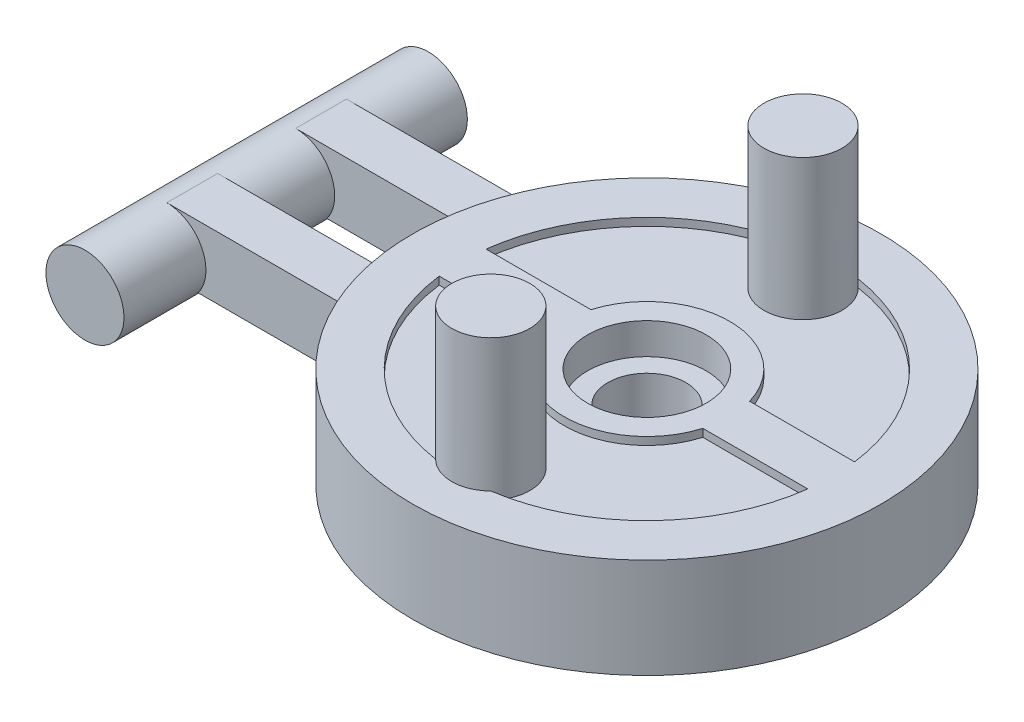
ISO-10303-21;
HEADER;
FILE_DESCRIPTION(('STEP AP214'),'2;1');
FILE_NAME('part.step','',(''),(''),'','','');
FILE_SCHEMA(('AUTOMOTIVE_DESIGN { 1 0 10303 214 1 1 1 1 }'));
ENDSEC;
DATA;
#1=APPLICATION_CONTEXT('core data for automotive mechanical design processes');
#2=APPLICATION_PROTOCOL_DEFINITION('international standard','automotive_design',2000,#1);
#3=PRODUCT_CONTEXT('',#1,'mechanical');
#4=PRODUCT('Part','Part','',(#3));
#5=PRODUCT_RELATED_PRODUCT_CATEGORY('part','',(#4));
#6=PRODUCT_DEFINITION_FORMATION('','',#4);
#7=PRODUCT_DEFINITION_CONTEXT('part definition',#1,'design');
#8=PRODUCT_DEFINITION('design','',#6,#7);
#9=PRODUCT_DEFINITION_SHAPE('','',#8);
#10=(LENGTH_UNIT() NAMED_UNIT(*) SI_UNIT(.MILLI.,.METRE.));
#11=(NAMED_UNIT(*) PLANE_ANGLE_UNIT() SI_UNIT($,.RADIAN.));
#12=(NAMED_UNIT(*) SI_UNIT($,.STERADIAN.) SOLID_ANGLE_UNIT());
#13=UNCERTAINTY_MEASURE_WITH_UNIT(LENGTH_MEASURE(1.E-05),#10,'distance_accuracy_value','');
#14=(GEOMETRIC_REPRESENTATION_CONTEXT(3) GLOBAL_UNCERTAINTY_ASSIGNED_CONTEXT((#13)) GLOBAL_UNIT_ASSIGNED_CONTEXT((#10,
#11,#12)) REPRESENTATION_CONTEXT('',''));
#15=CARTESIAN_POINT('',(0.,0.,0.));
#16=DIRECTION('',(0.,0.,1.));
#17=DIRECTION('',(1.,0.,0.));
#18=AXIS2_PLACEMENT_3D('',#15,#16,#17);
#19=CARTESIAN_POINT('',(0.,2.,0.));
#20=DIRECTION('',(0.,-1.,0.));
#21=DIRECTION('',(0.,0.,-1.));
#22=AXIS2_PLACEMENT_3D('',#19,#20,#21);
#23=PLANE('',#22);
#24=DIRECTION('',(1.,0.,0.));
#25=VECTOR('',#24,1.);
#26=CARTESIAN_POINT('',(-13.,2.,5.75));
#27=LINE('',#26,#25);
#28=CARTESIAN_POINT('',(-23.,2.,5.75));
#29=VERTEX_POINT('',#28);
#30=CARTESIAN_POINT('',(-13.8541510024974,2.,5.75));
#31=VERTEX_POINT('',#30);
#32=EDGE_CURVE('E207',#29,#31,#27,.T.);
#33=ORIENTED_EDGE('',*,*,#32,.F.);
#34=DIRECTION('',(0.,0.,-1.));
#35=VECTOR('',#34,1.);
#36=CARTESIAN_POINT('',(-23.,2.,11.));
#37=LINE('',#36,#35);
#38=CARTESIAN_POINT('',(-23.,2.,2.5));
#39=VERTEX_POINT('',#38);
#40=EDGE_CURVE('E737',#29,#39,#37,.T.);
#41=ORIENTED_EDGE('',*,*,#40,.T.);
#42=DIRECTION('',(-1.,0.,0.));
#43=VECTOR('',#42,1.);
#44=CARTESIAN_POINT('',(-13.,2.,2.5));
#45=LINE('',#44,#43);
#46=CARTESIAN_POINT('',(-14.790199457749,2.,2.5));
#47=VERTEX_POINT('',#46);
#48=EDGE_CURVE('E200',#47,#39,#45,.T.);
#49=ORIENTED_EDGE('',*,*,#48,.F.);
#50=CARTESIAN_POINT('',(0.,2.,0.));
#51=DIRECTION('',(0.,-1.,0.));
#52=DIRECTION('',(0.,0.,-1.));
#53=AXIS2_PLACEMENT_3D('',#50,#51,#52);
#54=CIRCLE('',#53,15.);
#55=EDGE_CURVE('E223',#31,#47,#54,.T.);
#56=ORIENTED_EDGE('',*,*,#55,.F.);
#57=EDGE_LOOP('',(#33,#41,#49,#56));
#58=FACE_BOUND('',#57,.T.);
#59=ADVANCED_FACE('F32',(#58),#23,.T.);
#60=CARTESIAN_POINT('',(0.,2.,0.));
#61=DIRECTION('',(0.,-1.,0.));
#62=DIRECTION('',(0.,0.,-1.));
#63=AXIS2_PLACEMENT_3D('',#60,#61,#62);
#64=PLANE('',#63);
#65=DIRECTION('',(1.,0.,0.));
#66=VECTOR('',#65,1.);
#67=CARTESIAN_POINT('',(-13.,2.,-2.5));
#68=LINE('',#67,#66);
#69=CARTESIAN_POINT('',(-23.,2.,-2.5));
#70=VERTEX_POINT('',#69);
#71=CARTESIAN_POINT('',(-14.790199457749,2.,-2.5));
#72=VERTEX_POINT('',#71);
#73=EDGE_CURVE('E176',#70,#72,#68,.T.);
#74=ORIENTED_EDGE('',*,*,#73,.F.);
#75=DIRECTION('',(0.,0.,-1.));
#76=VECTOR('',#75,1.);
#77=CARTESIAN_POINT('',(-23.,2.,11.));
#78=LINE('',#77,#76);
#79=CARTESIAN_POINT('',(-23.,2.,-5.75));
#80=VERTEX_POINT('',#79);
#81=EDGE_CURVE('E11',#70,#80,#78,.T.);
#82=ORIENTED_EDGE('',*,*,#81,.T.);
#83=DIRECTION('',(-1.,0.,0.));
#84=VECTOR('',#83,1.);
#85=CARTESIAN_POINT('',(-13.,2.,-5.75));
#86=LINE('',#85,#84);
#87=CARTESIAN_POINT('',(-13.8541510024974,2.,-5.75));
#88=VERTEX_POINT('',#87);
#89=EDGE_CURVE('E187',#88,#80,#86,.T.);
#90=ORIENTED_EDGE('',*,*,#89,.F.);
#91=CARTESIAN_POINT('',(0.,2.,0.));
#92=DIRECTION('',(0.,-1.,0.));
#93=DIRECTION('',(0.,0.,-1.));
#94=AXIS2_PLACEMENT_3D('',#91,#92,#93);
#95=CIRCLE('',#94,15.);
#96=EDGE_CURVE('E184',#72,#88,#95,.T.);
#97=ORIENTED_EDGE('',*,*,#96,.F.);
#98=EDGE_LOOP('',(#74,#82,#90,#97));
#99=FACE_BOUND('',#98,.T.);
#100=ADVANCED_FACE('F182',(#99),#64,.T.);
#101=CARTESIAN_POINT('',(0.,6.4,0.));
#102=DIRECTION('',(0.,-1.,0.));
#103=DIRECTION('',(0.,0.,-1.));
#104=AXIS2_PLACEMENT_3D('',#101,#102,#103);
#105=CYLINDRICAL_SURFACE('',#104,15.);
#106=CARTESIAN_POINT('',(0.,6.,0.));
#107=DIRECTION('',(0.,-1.,0.));
#108=DIRECTION('',(0.,0.,-1.));
#109=AXIS2_PLACEMENT_3D('',#106,#107,#108);
#110=CIRCLE('',#109,15.);
#111=CARTESIAN_POINT('',(-13.8541510024974,6.,5.75));
#112=VERTEX_POINT('',#111);
#113=CARTESIAN_POINT('',(-14.790199457749,6.,2.5));
#114=VERTEX_POINT('',#113);
#115=EDGE_CURVE('E339',#112,#114,#110,.T.);
#116=ORIENTED_EDGE('',*,*,#115,.F.);
#117=DIRECTION('',(0.,-1.,0.));
#118=VECTOR('',#117,1.);
#119=CARTESIAN_POINT('',(-13.8541510024974,6.4,5.75));
#120=LINE('',#119,#118);
#121=EDGE_CURVE('E337',#31,#112,#120,.F.);
#122=ORIENTED_EDGE('',*,*,#121,.F.);
#123=ORIENTED_EDGE('',*,*,#55,.T.);
#124=DIRECTION('',(0.,-1.,0.));
#125=VECTOR('',#124,1.);
#126=CARTESIAN_POINT('',(-14.790199457749,6.4,2.5));
#127=LINE('',#126,#125);
#128=EDGE_CURVE('E334',#114,#47,#127,.T.);
#129=ORIENTED_EDGE('',*,*,#128,.F.);
#130=EDGE_LOOP('',(#116,#122,#123,#129));
#131=FACE_BOUND('',#130,.T.);
#132=CARTESIAN_POINT('',(0.,6.4,0.));
#133=DIRECTION('',(0.,1.,0.));
#134=DIRECTION('',(0.,0.,1.));
#135=AXIS2_PLACEMENT_3D('',#132,#133,#134);
#136=CIRCLE('',#135,15.);
#137=CARTESIAN_POINT('',(0.,6.4,15.));
#138=VERTEX_POINT('',#137);
#139=EDGE_CURVE('E224',#138,#138,#136,.T.);
#140=ORIENTED_EDGE('',*,*,#139,.F.);
#141=EDGE_LOOP('',(#140));
#142=FACE_BOUND('',#141,.T.);
#143=CARTESIAN_POINT('',(0.,0.,0.));
#144=DIRECTION('',(0.,1.,0.));
#145=DIRECTION('',(0.,0.,1.));
#146=AXIS2_PLACEMENT_3D('',#143,#144,#145);
#147=CIRCLE('',#146,15.);
#148=CARTESIAN_POINT('',(0.,0.,15.));
#149=VERTEX_POINT('',#148);
#150=EDGE_CURVE('E287',#149,#149,#147,.T.);
#151=ORIENTED_EDGE('',*,*,#150,.T.);
#152=EDGE_LOOP('',(#151));
#153=FACE_BOUND('',#152,.T.);
#154=CARTESIAN_POINT('',(0.,6.,0.));
#155=DIRECTION('',(0.,-1.,0.));
#156=DIRECTION('',(0.,0.,-1.));
#157=AXIS2_PLACEMENT_3D('',#154,#155,#156);
#158=CIRCLE('',#157,15.);
#159=CARTESIAN_POINT('',(-14.790199457749,6.,-2.5));
#160=VERTEX_POINT('',#159);
#161=CARTESIAN_POINT('',(-13.8541510024974,6.,-5.75));
#162=VERTEX_POINT('',#161);
#163=EDGE_CURVE('E40',#160,#162,#158,.T.);
#164=ORIENTED_EDGE('',*,*,#163,.F.);
#165=DIRECTION('',(0.,-1.,0.));
#166=VECTOR('',#165,1.);
#167=CARTESIAN_POINT('',(-14.790199457749,6.4,-2.5));
#168=LINE('',#167,#166);
#169=EDGE_CURVE('E342',#72,#160,#168,.F.);
#170=ORIENTED_EDGE('',*,*,#169,.F.);
#171=ORIENTED_EDGE('',*,*,#96,.T.);
#172=DIRECTION('',(0.,-1.,0.));
#173=VECTOR('',#172,1.);
#174=CARTESIAN_POINT('',(-13.8541510024974,6.4,-5.75));
#175=LINE('',#174,#173);
#176=EDGE_CURVE('E344',#162,#88,#175,.T.);
#177=ORIENTED_EDGE('',*,*,#176,.F.);
#178=EDGE_LOOP('',(#164,#170,#171,#177));
#179=FACE_BOUND('',#178,.T.);
#180=ADVANCED_FACE('F34',(#131,#142,#153,#179),#105,.T.);
#181=CARTESIAN_POINT('',(0.,5.9,0.));
#182=DIRECTION('',(0.,1.,0.));
#183=DIRECTION('',(0.,0.,1.));
#184=AXIS2_PLACEMENT_3D('',#181,#182,#183);
#185=CYLINDRICAL_SURFACE('',#184,11.9);
#186=CARTESIAN_POINT('',(0.,5.9,0.));
#187=DIRECTION('',(0.,1.,0.));
#188=DIRECTION('',(0.,0.,1.));
#189=AXIS2_PLACEMENT_3D('',#186,#187,#188);
#190=CIRCLE('',#189,11.9);
#191=CARTESIAN_POINT('',(-11.805083650699,5.9,-1.5));
#192=VERTEX_POINT('',#191);
#193=CARTESIAN_POINT('',(-1.76753387520579,5.9,-11.768));
#194=VERTEX_POINT('',#193);
#195=EDGE_CURVE('E306',#192,#194,#190,.F.);
#196=ORIENTED_EDGE('',*,*,#195,.T.);
#197=DIRECTION('',(0.,-1.,0.));
#198=VECTOR('',#197,1.);
#199=CARTESIAN_POINT('',(-1.76753387520579,10.4,-11.768));
#200=LINE('',#199,#198);
#201=CARTESIAN_POINT('',(-1.76753387520579,6.4,-11.768));
#202=VERTEX_POINT('',#201);
#203=EDGE_CURVE('E241',#194,#202,#200,.F.);
#204=ORIENTED_EDGE('',*,*,#203,.T.);
#205=CARTESIAN_POINT('',(0.,6.4,0.));
#206=DIRECTION('',(0.,1.,0.));
#207=DIRECTION('',(0.,0.,1.));
#208=AXIS2_PLACEMENT_3D('',#205,#206,#207);
#209=CIRCLE('',#208,11.9);
#210=CARTESIAN_POINT('',(-11.805083650699,6.4,-1.5));
#211=VERTEX_POINT('',#210);
#212=EDGE_CURVE('E299',#211,#202,#209,.F.);
#213=ORIENTED_EDGE('',*,*,#212,.F.);
#214=DIRECTION('',(0.,1.,0.));
#215=VECTOR('',#214,1.);
#216=CARTESIAN_POINT('',(-11.805083650699,5.9,-1.5));
#217=LINE('',#216,#215);
#218=EDGE_CURVE('E275',#192,#211,#217,.T.);
#219=ORIENTED_EDGE('',*,*,#218,.F.);
#220=EDGE_LOOP('',(#196,#204,#213,#219));
#221=FACE_BOUND('',#220,.T.);
#222=ADVANCED_FACE('F355',(#221),#185,.F.);
#223=CARTESIAN_POINT('',(1.76753387520579,6.4,-11.768));
#224=VERTEX_POINT('',#223);
#225=CARTESIAN_POINT('',(11.805083650699,6.4,-1.5));
#226=VERTEX_POINT('',#225);
#227=EDGE_CURVE('E317',#224,#226,#209,.F.);
#228=ORIENTED_EDGE('',*,*,#227,.F.);
#229=DIRECTION('',(0.,-1.,0.));
#230=VECTOR('',#229,1.);
#231=CARTESIAN_POINT('',(1.76753387520579,10.4,-11.768));
#232=LINE('',#231,#230);
#233=CARTESIAN_POINT('',(1.76753387520579,5.9,-11.768));
#234=VERTEX_POINT('',#233);
#235=EDGE_CURVE('E234',#224,#234,#232,.T.);
#236=ORIENTED_EDGE('',*,*,#235,.T.);
#237=CARTESIAN_POINT('',(11.805083650699,5.9,-1.5));
#238=VERTEX_POINT('',#237);
#239=EDGE_CURVE('E305',#234,#238,#190,.F.);
#240=ORIENTED_EDGE('',*,*,#239,.T.);
#241=DIRECTION('',(0.,1.,0.));
#242=VECTOR('',#241,1.);
#243=CARTESIAN_POINT('',(11.805083650699,5.9,-1.5));
#244=LINE('',#243,#242);
#245=EDGE_CURVE('E321',#238,#226,#244,.T.);
#246=ORIENTED_EDGE('',*,*,#245,.T.);
#247=EDGE_LOOP('',(#228,#236,#240,#246));
#248=FACE_BOUND('',#247,.T.);
#249=ADVANCED_FACE('F361',(#248),#185,.F.);
#250=CARTESIAN_POINT('',(0.,5.9,0.));
#251=DIRECTION('',(0.,1.,0.));
#252=DIRECTION('',(0.,0.,1.));
#253=AXIS2_PLACEMENT_3D('',#250,#251,#252);
#254=CYLINDRICAL_SURFACE('',#253,11.9);
#255=DIRECTION('',(0.,-1.,0.));
#256=VECTOR('',#255,1.);
#257=CARTESIAN_POINT('',(1.76753387520579,10.4,11.768));
#258=LINE('',#257,#256);
#259=CARTESIAN_POINT('',(1.76753387520579,6.4,11.768));
#260=VERTEX_POINT('',#259);
#261=CARTESIAN_POINT('',(1.76753387520579,5.9,11.768));
#262=VERTEX_POINT('',#261);
#263=EDGE_CURVE('E254',#260,#262,#258,.T.);
#264=ORIENTED_EDGE('',*,*,#263,.F.);
#265=CARTESIAN_POINT('',(0.,6.4,0.));
#266=DIRECTION('',(0.,1.,0.));
#267=DIRECTION('',(0.,0.,1.));
#268=AXIS2_PLACEMENT_3D('',#265,#266,#267);
#269=CIRCLE('',#268,11.9);
#270=CARTESIAN_POINT('',(11.805083650699,6.4,1.5));
#271=VERTEX_POINT('',#270);
#272=EDGE_CURVE('E278',#260,#271,#269,.T.);
#273=ORIENTED_EDGE('',*,*,#272,.T.);
#274=DIRECTION('',(0.,1.,0.));
#275=VECTOR('',#274,1.);
#276=CARTESIAN_POINT('',(11.805083650699,5.9,1.5));
#277=LINE('',#276,#275);
#278=CARTESIAN_POINT('',(11.805083650699,5.9,1.5));
#279=VERTEX_POINT('',#278);
#280=EDGE_CURVE('E288',#279,#271,#277,.T.);
#281=ORIENTED_EDGE('',*,*,#280,.F.);
#282=CARTESIAN_POINT('',(0.,5.9,0.));
#283=DIRECTION('',(0.,1.,0.));
#284=DIRECTION('',(0.,0.,1.));
#285=AXIS2_PLACEMENT_3D('',#282,#283,#284);
#286=CIRCLE('',#285,11.9);
#287=EDGE_CURVE('E263',#262,#279,#286,.T.);
#288=ORIENTED_EDGE('',*,*,#287,.F.);
#289=EDGE_LOOP('',(#264,#273,#281,#288));
#290=FACE_BOUND('',#289,.T.);
#291=ADVANCED_FACE('F431',(#290),#254,.F.);
#292=DIRECTION('',(0.,-1.,0.));
#293=VECTOR('',#292,1.);
#294=CARTESIAN_POINT('',(-1.76753387520579,10.4,11.768));
#295=LINE('',#294,#293);
#296=CARTESIAN_POINT('',(-1.76753387520579,5.9,11.768));
#297=VERTEX_POINT('',#296);
#298=CARTESIAN_POINT('',(-1.7675338752058,6.4,11.768));
#299=VERTEX_POINT('',#298);
#300=EDGE_CURVE('E248',#297,#299,#295,.F.);
#301=ORIENTED_EDGE('',*,*,#300,.F.);
#302=CARTESIAN_POINT('',(-11.805083650699,5.9,1.5));
#303=VERTEX_POINT('',#302);
#304=EDGE_CURVE('E264',#303,#297,#286,.T.);
#305=ORIENTED_EDGE('',*,*,#304,.F.);
#306=DIRECTION('',(0.,1.,0.));
#307=VECTOR('',#306,1.);
#308=CARTESIAN_POINT('',(-11.805083650699,5.9,1.5));
#309=LINE('',#308,#307);
#310=CARTESIAN_POINT('',(-11.805083650699,6.4,1.5));
#311=VERTEX_POINT('',#310);
#312=EDGE_CURVE('E291',#303,#311,#309,.T.);
#313=ORIENTED_EDGE('',*,*,#312,.T.);
#314=EDGE_CURVE('E279',#311,#299,#269,.T.);
#315=ORIENTED_EDGE('',*,*,#314,.T.);
#316=EDGE_LOOP('',(#301,#305,#313,#315));
#317=FACE_BOUND('',#316,.T.);
#318=ADVANCED_FACE('F434',(#317),#254,.F.);
#319=CARTESIAN_POINT('',(0.,6.4,0.));
#320=DIRECTION('',(0.,1.,0.));
#321=DIRECTION('',(0.,0.,1.));
#322=AXIS2_PLACEMENT_3D('',#319,#320,#321);
#323=PLANE('',#322);
#324=CARTESIAN_POINT('',(0.,6.4,0.));
#325=DIRECTION('',(0.,1.,0.));
#326=DIRECTION('',(0.,0.,1.));
#327=AXIS2_PLACEMENT_3D('',#324,#325,#326);
#328=CIRCLE('',#327,3.8);
#329=CARTESIAN_POINT('',(0.,6.4,3.8));
#330=VERTEX_POINT('',#329);
#331=EDGE_CURVE('E219',#330,#330,#328,.T.);
#332=ORIENTED_EDGE('',*,*,#331,.F.);
#333=EDGE_LOOP('',(#332));
#334=FACE_BOUND('',#333,.T.);
#335=ORIENTED_EDGE('',*,*,#272,.F.);
#336=CARTESIAN_POINT('',(0.,6.4,10.));
#337=DIRECTION('',(0.,1.,0.));
#338=DIRECTION('',(0.,0.,1.));
#339=AXIS2_PLACEMENT_3D('',#336,#337,#338);
#340=CIRCLE('',#339,2.5);
#341=EDGE_CURVE('E251',#260,#299,#340,.F.);
#342=ORIENTED_EDGE('',*,*,#341,.T.);
#343=ORIENTED_EDGE('',*,*,#314,.F.);
#344=DIRECTION('',(1.,0.,0.));
#345=VECTOR('',#344,1.);
#346=CARTESIAN_POINT('',(0.,6.4,1.5));
#347=LINE('',#346,#345);
#348=CARTESIAN_POINT('',(-5.08330601085553,6.4,1.5));
#349=VERTEX_POINT('',#348);
#350=EDGE_CURVE('E274',#311,#349,#347,.T.);
#351=ORIENTED_EDGE('',*,*,#350,.T.);
#352=CARTESIAN_POINT('',(0.,6.4,0.));
#353=DIRECTION('',(0.,1.,0.));
#354=DIRECTION('',(0.,0.,1.));
#355=AXIS2_PLACEMENT_3D('',#352,#353,#354);
#356=CIRCLE('',#355,5.3);
#357=CARTESIAN_POINT('',(5.08330601085553,6.4,1.5));
#358=VERTEX_POINT('',#357);
#359=EDGE_CURVE('E271',#349,#358,#356,.T.);
#360=ORIENTED_EDGE('',*,*,#359,.T.);
#361=DIRECTION('',(1.,0.,0.));
#362=VECTOR('',#361,1.);
#363=CARTESIAN_POINT('',(0.,6.4,1.5));
#364=LINE('',#363,#362);
#365=EDGE_CURVE('E261',#358,#271,#364,.T.);
#366=ORIENTED_EDGE('',*,*,#365,.T.);
#367=EDGE_LOOP('',(#335,#342,#343,#351,#360,#366));
#368=FACE_BOUND('',#367,.T.);
#369=ORIENTED_EDGE('',*,*,#139,.T.);
#370=EDGE_LOOP('',(#369));
#371=FACE_BOUND('',#370,.T.);
#372=ORIENTED_EDGE('',*,*,#212,.T.);
#373=CARTESIAN_POINT('',(0.,6.4,-10.));
#374=DIRECTION('',(0.,1.,0.));
#375=DIRECTION('',(0.,0.,1.));
#376=AXIS2_PLACEMENT_3D('',#373,#374,#375);
#377=CIRCLE('',#376,2.5);
#378=EDGE_CURVE('E238',#202,#224,#377,.F.);
#379=ORIENTED_EDGE('',*,*,#378,.T.);
#380=ORIENTED_EDGE('',*,*,#227,.T.);
#381=DIRECTION('',(1.,0.,0.));
#382=VECTOR('',#381,1.);
#383=CARTESIAN_POINT('',(0.,6.4,-1.5));
#384=LINE('',#383,#382);
#385=CARTESIAN_POINT('',(5.08330601085553,6.4,-1.5));
#386=VERTEX_POINT('',#385);
#387=EDGE_CURVE('E314',#386,#226,#384,.T.);
#388=ORIENTED_EDGE('',*,*,#387,.F.);
#389=CARTESIAN_POINT('',(0.,6.4,0.));
#390=DIRECTION('',(0.,1.,0.));
#391=DIRECTION('',(0.,0.,1.));
#392=AXIS2_PLACEMENT_3D('',#389,#390,#391);
#393=CIRCLE('',#392,5.3);
#394=CARTESIAN_POINT('',(-5.08330601085553,6.4,-1.5));
#395=VERTEX_POINT('',#394);
#396=EDGE_CURVE('E311',#395,#386,#393,.F.);
#397=ORIENTED_EDGE('',*,*,#396,.F.);
#398=DIRECTION('',(1.,0.,0.));
#399=VECTOR('',#398,1.);
#400=CARTESIAN_POINT('',(0.,6.4,-1.5));
#401=LINE('',#400,#399);
#402=EDGE_CURVE('E256',#211,#395,#401,.T.);
#403=ORIENTED_EDGE('',*,*,#402,.F.);
#404=EDGE_LOOP('',(#372,#379,#380,#388,#397,#403));
#405=FACE_BOUND('',#404,.T.);
#406=ADVANCED_FACE('F459',(#334,#368,#371,#405),#323,.T.);
#407=CARTESIAN_POINT('',(0.,0.,0.));
#408=DIRECTION('',(0.,1.,0.));
#409=DIRECTION('',(0.,0.,1.));
#410=AXIS2_PLACEMENT_3D('',#407,#408,#409);
#411=PLANE('',#410);
#412=CARTESIAN_POINT('',(0.,0.,0.));
#413=DIRECTION('',(0.,-1.,0.));
#414=DIRECTION('',(0.,0.,-1.));
#415=AXIS2_PLACEMENT_3D('',#412,#413,#414);
#416=CIRCLE('',#415,4.);
#417=CARTESIAN_POINT('',(0.,0.,-4.));
#418=VERTEX_POINT('',#417);
#419=EDGE_CURVE('E220',#418,#418,#416,.T.);
#420=ORIENTED_EDGE('',*,*,#419,.F.);
#421=EDGE_LOOP('',(#420));
#422=FACE_BOUND('',#421,.T.);
#423=ORIENTED_EDGE('',*,*,#150,.F.);
#424=EDGE_LOOP('',(#423));
#425=FACE_BOUND('',#424,.T.);
#426=ADVANCED_FACE('F457',(#422,#425),#411,.F.);
#427=CARTESIAN_POINT('',(0.,5.9,-1.5));
#428=DIRECTION('',(0.,0.,1.));
#429=DIRECTION('',(1.,0.,0.));
#430=AXIS2_PLACEMENT_3D('',#427,#428,#429);
#431=PLANE('',#430);
#432=ORIENTED_EDGE('',*,*,#402,.T.);
#433=DIRECTION('',(0.,1.,0.));
#434=VECTOR('',#433,1.);
#435=CARTESIAN_POINT('',(-5.08330601085553,5.9,-1.5));
#436=LINE('',#435,#434);
#437=CARTESIAN_POINT('',(-5.08330601085553,5.9,-1.5));
#438=VERTEX_POINT('',#437);
#439=EDGE_CURVE('E309',#438,#395,#436,.T.);
#440=ORIENTED_EDGE('',*,*,#439,.F.);
#441=DIRECTION('',(1.,0.,0.));
#442=VECTOR('',#441,1.);
#443=CARTESIAN_POINT('',(0.,5.9,-1.5));
#444=LINE('',#443,#442);
#445=EDGE_CURVE('E295',#192,#438,#444,.T.);
#446=ORIENTED_EDGE('',*,*,#445,.F.);
#447=ORIENTED_EDGE('',*,*,#218,.T.);
#448=EDGE_LOOP('',(#432,#440,#446,#447));
#449=FACE_BOUND('',#448,.T.);
#450=ADVANCED_FACE('F450',(#449),#431,.F.);
#451=CARTESIAN_POINT('',(0.,5.9,-1.5));
#452=DIRECTION('',(0.,0.,1.));
#453=DIRECTION('',(1.,0.,0.));
#454=AXIS2_PLACEMENT_3D('',#451,#452,#453);
#455=PLANE('',#454);
#456=ORIENTED_EDGE('',*,*,#387,.T.);
#457=ORIENTED_EDGE('',*,*,#245,.F.);
#458=DIRECTION('',(1.,0.,0.));
#459=VECTOR('',#458,1.);
#460=CARTESIAN_POINT('',(0.,5.9,-1.5));
#461=LINE('',#460,#459);
#462=CARTESIAN_POINT('',(5.08330601085553,5.9,-1.5));
#463=VERTEX_POINT('',#462);
#464=EDGE_CURVE('E302',#463,#238,#461,.T.);
#465=ORIENTED_EDGE('',*,*,#464,.F.);
#466=DIRECTION('',(0.,1.,0.));
#467=VECTOR('',#466,1.);
#468=CARTESIAN_POINT('',(5.08330601085553,5.9,-1.5));
#469=LINE('',#468,#467);
#470=EDGE_CURVE('E324',#463,#386,#469,.T.);
#471=ORIENTED_EDGE('',*,*,#470,.T.);
#472=EDGE_LOOP('',(#456,#457,#465,#471));
#473=FACE_BOUND('',#472,.T.);
#474=ADVANCED_FACE('F447',(#473),#455,.F.);
#475=CARTESIAN_POINT('',(0.,5.9,0.));
#476=DIRECTION('',(0.,1.,0.));
#477=DIRECTION('',(0.,0.,1.));
#478=AXIS2_PLACEMENT_3D('',#475,#476,#477);
#479=CYLINDRICAL_SURFACE('',#478,5.3);
#480=ORIENTED_EDGE('',*,*,#396,.T.);
#481=ORIENTED_EDGE('',*,*,#470,.F.);
#482=CARTESIAN_POINT('',(0.,5.9,0.));
#483=DIRECTION('',(0.,1.,0.));
#484=DIRECTION('',(0.,0.,1.));
#485=AXIS2_PLACEMENT_3D('',#482,#483,#484);
#486=CIRCLE('',#485,5.3);
#487=EDGE_CURVE('E298',#438,#463,#486,.F.);
#488=ORIENTED_EDGE('',*,*,#487,.F.);
#489=ORIENTED_EDGE('',*,*,#439,.T.);
#490=EDGE_LOOP('',(#480,#481,#488,#489));
#491=FACE_BOUND('',#490,.T.);
#492=ADVANCED_FACE('F444',(#491),#479,.T.);
#493=CARTESIAN_POINT('',(0.,5.9,0.));
#494=DIRECTION('',(0.,1.,0.));
#495=DIRECTION('',(0.,0.,1.));
#496=AXIS2_PLACEMENT_3D('',#493,#494,#495);
#497=PLANE('',#496);
#498=ORIENTED_EDGE('',*,*,#239,.F.);
#499=CARTESIAN_POINT('',(0.,5.9,-10.));
#500=DIRECTION('',(0.,1.,0.));
#501=DIRECTION('',(0.,0.,-1.));
#502=AXIS2_PLACEMENT_3D('',#499,#500,#501);
#503=CIRCLE('',#502,2.5);
#504=EDGE_CURVE('E228',#194,#234,#503,.T.);
#505=ORIENTED_EDGE('',*,*,#504,.F.);
#506=ORIENTED_EDGE('',*,*,#195,.F.);
#507=ORIENTED_EDGE('',*,*,#445,.T.);
#508=ORIENTED_EDGE('',*,*,#487,.T.);
#509=ORIENTED_EDGE('',*,*,#464,.T.);
#510=EDGE_LOOP('',(#498,#505,#506,#507,#508,#509));
#511=FACE_BOUND('',#510,.T.);
#512=ADVANCED_FACE('F441',(#511),#497,.T.);
#513=CARTESIAN_POINT('',(0.,5.9,0.));
#514=DIRECTION('',(0.,1.,0.));
#515=DIRECTION('',(0.,0.,1.));
#516=AXIS2_PLACEMENT_3D('',#513,#514,#515);
#517=CYLINDRICAL_SURFACE('',#516,5.3);
#518=ORIENTED_EDGE('',*,*,#359,.F.);
#519=DIRECTION('',(0.,1.,0.));
#520=VECTOR('',#519,1.);
#521=CARTESIAN_POINT('',(-5.08330601085553,5.9,1.5));
#522=LINE('',#521,#520);
#523=CARTESIAN_POINT('',(-5.08330601085553,5.9,1.5));
#524=VERTEX_POINT('',#523);
#525=EDGE_CURVE('E270',#524,#349,#522,.T.);
#526=ORIENTED_EDGE('',*,*,#525,.F.);
#527=CARTESIAN_POINT('',(0.,5.9,0.));
#528=DIRECTION('',(0.,1.,0.));
#529=DIRECTION('',(0.,0.,1.));
#530=AXIS2_PLACEMENT_3D('',#527,#528,#529);
#531=CIRCLE('',#530,5.3);
#532=CARTESIAN_POINT('',(5.08330601085553,5.9,1.5));
#533=VERTEX_POINT('',#532);
#534=EDGE_CURVE('E257',#524,#533,#531,.T.);
#535=ORIENTED_EDGE('',*,*,#534,.T.);
#536=DIRECTION('',(0.,1.,0.));
#537=VECTOR('',#536,1.);
#538=CARTESIAN_POINT('',(5.08330601085553,5.9,1.5));
#539=LINE('',#538,#537);
#540=EDGE_CURVE('E284',#533,#358,#539,.T.);
#541=ORIENTED_EDGE('',*,*,#540,.T.);
#542=EDGE_LOOP('',(#518,#526,#535,#541));
#543=FACE_BOUND('',#542,.T.);
#544=ADVANCED_FACE('F429',(#543),#517,.T.);
#545=CARTESIAN_POINT('',(0.,5.9,1.5));
#546=DIRECTION('',(0.,0.,1.));
#547=DIRECTION('',(1.,0.,0.));
#548=AXIS2_PLACEMENT_3D('',#545,#546,#547);
#549=PLANE('',#548);
#550=ORIENTED_EDGE('',*,*,#365,.F.);
#551=ORIENTED_EDGE('',*,*,#540,.F.);
#552=DIRECTION('',(1.,0.,0.));
#553=VECTOR('',#552,1.);
#554=CARTESIAN_POINT('',(0.,5.9,1.5));
#555=LINE('',#554,#553);
#556=EDGE_CURVE('E267',#533,#279,#555,.T.);
#557=ORIENTED_EDGE('',*,*,#556,.T.);
#558=ORIENTED_EDGE('',*,*,#280,.T.);
#559=EDGE_LOOP('',(#550,#551,#557,#558));
#560=FACE_BOUND('',#559,.T.);
#561=ADVANCED_FACE('F426',(#560),#549,.T.);
#562=CARTESIAN_POINT('',(0.,5.9,1.5));
#563=DIRECTION('',(0.,0.,1.));
#564=DIRECTION('',(1.,0.,0.));
#565=AXIS2_PLACEMENT_3D('',#562,#563,#564);
#566=PLANE('',#565);
#567=ORIENTED_EDGE('',*,*,#350,.F.);
#568=ORIENTED_EDGE('',*,*,#312,.F.);
#569=DIRECTION('',(1.,0.,0.));
#570=VECTOR('',#569,1.);
#571=CARTESIAN_POINT('',(0.,5.9,1.5));
#572=LINE('',#571,#570);
#573=EDGE_CURVE('E260',#303,#524,#572,.T.);
#574=ORIENTED_EDGE('',*,*,#573,.T.);
#575=ORIENTED_EDGE('',*,*,#525,.T.);
#576=EDGE_LOOP('',(#567,#568,#574,#575));
#577=FACE_BOUND('',#576,.T.);
#578=ADVANCED_FACE('F424',(#577),#566,.T.);
#579=CARTESIAN_POINT('',(0.,5.9,0.));
#580=DIRECTION('',(0.,1.,0.));
#581=DIRECTION('',(0.,0.,1.));
#582=AXIS2_PLACEMENT_3D('',#579,#580,#581);
#583=PLANE('',#582);
#584=ORIENTED_EDGE('',*,*,#304,.T.);
#585=CARTESIAN_POINT('',(0.,5.9,10.));
#586=DIRECTION('',(0.,1.,0.));
#587=DIRECTION('',(0.,0.,1.));
#588=AXIS2_PLACEMENT_3D('',#585,#586,#587);
#589=CIRCLE('',#588,2.5);
#590=EDGE_CURVE('E244',#262,#297,#589,.T.);
#591=ORIENTED_EDGE('',*,*,#590,.F.);
#592=ORIENTED_EDGE('',*,*,#287,.T.);
#593=ORIENTED_EDGE('',*,*,#556,.F.);
#594=ORIENTED_EDGE('',*,*,#534,.F.);
#595=ORIENTED_EDGE('',*,*,#573,.F.);
#596=EDGE_LOOP('',(#584,#591,#592,#593,#594,#595));
#597=FACE_BOUND('',#596,.T.);
#598=ADVANCED_FACE('F420',(#597),#583,.T.);
#599=CARTESIAN_POINT('',(0.,14.9,10.));
#600=DIRECTION('',(0.,-1.,0.));
#601=DIRECTION('',(0.,0.,-1.));
#602=AXIS2_PLACEMENT_3D('',#599,#600,#601);
#603=CYLINDRICAL_SURFACE('',#602,2.5);
#604=CARTESIAN_POINT('',(0.,14.9,10.));
#605=DIRECTION('',(0.,1.,0.));
#606=DIRECTION('',(0.,0.,1.));
#607=AXIS2_PLACEMENT_3D('',#604,#605,#606);
#608=CIRCLE('',#607,2.5);
#609=CARTESIAN_POINT('',(0.,14.9,12.5));
#610=VERTEX_POINT('',#609);
#611=EDGE_CURVE('E245',#610,#610,#608,.T.);
#612=ORIENTED_EDGE('',*,*,#611,.F.);
#613=EDGE_LOOP('',(#612));
#614=FACE_BOUND('',#613,.T.);
#615=ORIENTED_EDGE('',*,*,#341,.F.);
#616=ORIENTED_EDGE('',*,*,#263,.T.);
#617=ORIENTED_EDGE('',*,*,#590,.T.);
#618=ORIENTED_EDGE('',*,*,#300,.T.);
#619=EDGE_LOOP('',(#615,#616,#617,#618));
#620=FACE_BOUND('',#619,.T.);
#621=ADVANCED_FACE('F416',(#614,#620),#603,.T.);
#622=CARTESIAN_POINT('',(0.,14.9,10.));
#623=DIRECTION('',(0.,1.,0.));
#624=DIRECTION('',(0.,0.,1.));
#625=AXIS2_PLACEMENT_3D('',#622,#623,#624);
#626=PLANE('',#625);
#627=ORIENTED_EDGE('',*,*,#611,.T.);
#628=EDGE_LOOP('',(#627));
#629=FACE_BOUND('',#628,.T.);
#630=ADVANCED_FACE('F412',(#629),#626,.T.);
#631=CARTESIAN_POINT('',(0.,14.9,-10.));
#632=DIRECTION('',(0.,-1.,0.));
#633=DIRECTION('',(0.,0.,-1.));
#634=AXIS2_PLACEMENT_3D('',#631,#632,#633);
#635=CYLINDRICAL_SURFACE('',#634,2.5);
#636=ORIENTED_EDGE('',*,*,#203,.F.);
#637=ORIENTED_EDGE('',*,*,#504,.T.);
#638=ORIENTED_EDGE('',*,*,#235,.F.);
#639=ORIENTED_EDGE('',*,*,#378,.F.);
#640=EDGE_LOOP('',(#636,#637,#638,#639));
#641=FACE_BOUND('',#640,.T.);
#642=CARTESIAN_POINT('',(0.,14.9,-10.));
#643=DIRECTION('',(0.,1.,0.));
#644=DIRECTION('',(0.,0.,-1.));
#645=AXIS2_PLACEMENT_3D('',#642,#643,#644);
#646=CIRCLE('',#645,2.5);
#647=CARTESIAN_POINT('',(0.,14.9,-12.5));
#648=VERTEX_POINT('',#647);
#649=EDGE_CURVE('E231',#648,#648,#646,.T.);
#650=ORIENTED_EDGE('',*,*,#649,.F.);
#651=EDGE_LOOP('',(#650));
#652=FACE_BOUND('',#651,.T.);
#653=ADVANCED_FACE('F408',(#641,#652),#635,.T.);
#654=CARTESIAN_POINT('',(0.,14.9,-10.));
#655=DIRECTION('',(0.,-1.,0.));
#656=DIRECTION('',(0.,0.,-1.));
#657=AXIS2_PLACEMENT_3D('',#654,#655,#656);
#658=PLANE('',#657);
#659=ORIENTED_EDGE('',*,*,#649,.T.);
#660=EDGE_LOOP('',(#659));
#661=FACE_BOUND('',#660,.T.);
#662=ADVANCED_FACE('F404',(#661),#658,.F.);
#663=CARTESIAN_POINT('',(0.,4.4,0.));
#664=DIRECTION('',(0.,1.,0.));
#665=DIRECTION('',(0.,0.,1.));
#666=AXIS2_PLACEMENT_3D('',#663,#664,#665);
#667=CYLINDRICAL_SURFACE('',#666,3.8);
#668=CARTESIAN_POINT('',(0.,4.4,0.));
#669=DIRECTION('',(0.,1.,0.));
#670=DIRECTION('',(0.,0.,1.));
#671=AXIS2_PLACEMENT_3D('',#668,#669,#670);
#672=CIRCLE('',#671,3.8);
#673=CARTESIAN_POINT('',(0.,4.4,3.8));
#674=VERTEX_POINT('',#673);
#675=EDGE_CURVE('E225',#674,#674,#672,.T.);
#676=ORIENTED_EDGE('',*,*,#675,.F.);
#677=EDGE_LOOP('',(#676));
#678=FACE_BOUND('',#677,.T.);
#679=ORIENTED_EDGE('',*,*,#331,.T.);
#680=EDGE_LOOP('',(#679));
#681=FACE_BOUND('',#680,.T.);
#682=ADVANCED_FACE('F400',(#678,#681),#667,.F.);
#683=CARTESIAN_POINT('',(0.,4.4,0.));
#684=DIRECTION('',(0.,1.,0.));
#685=DIRECTION('',(0.,0.,1.));
#686=AXIS2_PLACEMENT_3D('',#683,#684,#685);
#687=PLANE('',#686);
#688=CARTESIAN_POINT('',(0.,4.4,0.));
#689=DIRECTION('',(0.,1.,0.));
#690=DIRECTION('',(0.,0.,1.));
#691=AXIS2_PLACEMENT_3D('',#688,#689,#690);
#692=CIRCLE('',#691,2.5);
#693=CARTESIAN_POINT('',(0.,4.4,2.5));
#694=VERTEX_POINT('',#693);
#695=EDGE_CURVE('E206',#694,#694,#692,.T.);
#696=ORIENTED_EDGE('',*,*,#695,.F.);
#697=EDGE_LOOP('',(#696));
#698=FACE_BOUND('',#697,.T.);
#699=ORIENTED_EDGE('',*,*,#675,.T.);
#700=EDGE_LOOP('',(#699));
#701=FACE_BOUND('',#700,.T.);
#702=ADVANCED_FACE('F396',(#698,#701),#687,.T.);
#703=CARTESIAN_POINT('',(0.,-1.,0.));
#704=DIRECTION('',(0.,1.,0.));
#705=DIRECTION('',(0.,0.,1.));
#706=AXIS2_PLACEMENT_3D('',#703,#704,#705);
#707=CYLINDRICAL_SURFACE('',#706,4.);
#708=CARTESIAN_POINT('',(0.,-1.,0.));
#709=DIRECTION('',(0.,-1.,0.));
#710=DIRECTION('',(0.,0.,-1.));
#711=AXIS2_PLACEMENT_3D('',#708,#709,#710);
#712=CIRCLE('',#711,4.);
#713=CARTESIAN_POINT('',(0.,-1.,-4.));
#714=VERTEX_POINT('',#713);
#715=EDGE_CURVE('E214',#714,#714,#712,.T.);
#716=ORIENTED_EDGE('',*,*,#715,.F.);
#717=EDGE_LOOP('',(#716));
#718=FACE_BOUND('',#717,.T.);
#719=ORIENTED_EDGE('',*,*,#419,.T.);
#720=EDGE_LOOP('',(#719));
#721=FACE_BOUND('',#720,.T.);
#722=ADVANCED_FACE('F392',(#718,#721),#707,.T.);
#723=CARTESIAN_POINT('',(0.,-1.,0.));
#724=DIRECTION('',(0.,-1.,0.));
#725=DIRECTION('',(0.,0.,-1.));
#726=AXIS2_PLACEMENT_3D('',#723,#724,#725);
#727=PLANE('',#726);
#728=CARTESIAN_POINT('',(0.,-1.,0.));
#729=DIRECTION('',(0.,1.,0.));
#730=DIRECTION('',(0.,0.,1.));
#731=AXIS2_PLACEMENT_3D('',#728,#729,#730);
#732=CIRCLE('',#731,2.5);
#733=CARTESIAN_POINT('',(0.,-1.,2.5));
#734=VERTEX_POINT('',#733);
#735=EDGE_CURVE('E211',#734,#734,#732,.T.);
#736=ORIENTED_EDGE('',*,*,#735,.T.);
#737=EDGE_LOOP('',(#736));
#738=FACE_BOUND('',#737,.T.);
#739=ORIENTED_EDGE('',*,*,#715,.T.);
#740=EDGE_LOOP('',(#739));
#741=FACE_BOUND('',#740,.T.);
#742=ADVANCED_FACE('F388',(#738,#741),#727,.T.);
#743=CARTESIAN_POINT('',(0.,-1.,0.));
#744=DIRECTION('',(0.,1.,0.));
#745=DIRECTION('',(0.,0.,1.));
#746=AXIS2_PLACEMENT_3D('',#743,#744,#745);
#747=CYLINDRICAL_SURFACE('',#746,2.5);
#748=ORIENTED_EDGE('',*,*,#735,.F.);
#749=EDGE_LOOP('',(#748));
#750=FACE_BOUND('',#749,.T.);
#751=ORIENTED_EDGE('',*,*,#695,.T.);
#752=EDGE_LOOP('',(#751));
#753=FACE_BOUND('',#752,.T.);
#754=ADVANCED_FACE('F384',(#750,#753),#747,.F.);
#755=CARTESIAN_POINT('',(-13.,6.,5.75));
#756=DIRECTION('',(0.,0.,-1.));
#757=DIRECTION('',(-1.,0.,0.));
#758=AXIS2_PLACEMENT_3D('',#755,#756,#757);
#759=PLANE('',#758);
#760=CARTESIAN_POINT('',(-25.,3.5,5.75));
#761=DIRECTION('',(0.,0.,-1.));
#762=DIRECTION('',(-1.,0.,0.));
#763=AXIS2_PLACEMENT_3D('',#760,#761,#762);
#764=CIRCLE('',#763,2.5);
#765=CARTESIAN_POINT('',(-25.,6.,5.75));
#766=VERTEX_POINT('',#765);
#767=EDGE_CURVE('E192',#29,#766,#764,.F.);
#768=ORIENTED_EDGE('',*,*,#767,.F.);
#769=ORIENTED_EDGE('',*,*,#32,.T.);
#770=ORIENTED_EDGE('',*,*,#121,.T.);
#771=DIRECTION('',(1.,0.,0.));
#772=VECTOR('',#771,1.);
#773=CARTESIAN_POINT('',(-13.,6.,5.75));
#774=LINE('',#773,#772);
#775=EDGE_CURVE('E199',#766,#112,#774,.T.);
#776=ORIENTED_EDGE('',*,*,#775,.F.);
#777=EDGE_LOOP('',(#768,#769,#770,#776));
#778=FACE_BOUND('',#777,.T.);
#779=ADVANCED_FACE('F380',(#778),#759,.F.);
#780=CARTESIAN_POINT('',(-13.,6.,2.5));
#781=DIRECTION('',(0.,0.,1.));
#782=DIRECTION('',(1.,0.,0.));
#783=AXIS2_PLACEMENT_3D('',#780,#781,#782);
#784=PLANE('',#783);
#785=CARTESIAN_POINT('',(-25.,3.5,2.5));
#786=DIRECTION('',(0.,0.,1.));
#787=DIRECTION('',(1.,0.,0.));
#788=AXIS2_PLACEMENT_3D('',#785,#786,#787);
#789=CIRCLE('',#788,2.5);
#790=CARTESIAN_POINT('',(-25.,6.,2.5));
#791=VERTEX_POINT('',#790);
#792=EDGE_CURVE('E47',#791,#39,#789,.F.);
#793=ORIENTED_EDGE('',*,*,#792,.F.);
#794=DIRECTION('',(-1.,0.,0.));
#795=VECTOR('',#794,1.);
#796=CARTESIAN_POINT('',(-13.,6.,2.5));
#797=LINE('',#796,#795);
#798=EDGE_CURVE('E203',#114,#791,#797,.T.);
#799=ORIENTED_EDGE('',*,*,#798,.F.);
#800=ORIENTED_EDGE('',*,*,#128,.T.);
#801=ORIENTED_EDGE('',*,*,#48,.T.);
#802=EDGE_LOOP('',(#793,#799,#800,#801));
#803=FACE_BOUND('',#802,.T.);
#804=ADVANCED_FACE('F377',(#803),#784,.F.);
#805=CARTESIAN_POINT('',(0.,6.,0.));
#806=DIRECTION('',(0.,-1.,0.));
#807=DIRECTION('',(0.,0.,-1.));
#808=AXIS2_PLACEMENT_3D('',#805,#806,#807);
#809=PLANE('',#808);
#810=ORIENTED_EDGE('',*,*,#775,.T.);
#811=ORIENTED_EDGE('',*,*,#115,.T.);
#812=ORIENTED_EDGE('',*,*,#798,.T.);
#813=DIRECTION('',(0.,0.,1.));
#814=VECTOR('',#813,1.);
#815=CARTESIAN_POINT('',(-25.,6.,2.5));
#816=LINE('',#815,#814);
#817=EDGE_CURVE('E196',#791,#766,#816,.T.);
#818=ORIENTED_EDGE('',*,*,#817,.T.);
#819=EDGE_LOOP('',(#810,#811,#812,#818));
#820=FACE_BOUND('',#819,.T.);
#821=ADVANCED_FACE('F375',(#820),#809,.F.);
#822=CARTESIAN_POINT('',(-13.,6.,-5.75));
#823=DIRECTION('',(0.,0.,1.));
#824=DIRECTION('',(1.,0.,0.));
#825=AXIS2_PLACEMENT_3D('',#822,#823,#824);
#826=PLANE('',#825);
#827=CARTESIAN_POINT('',(-25.,3.5,-5.75));
#828=DIRECTION('',(0.,0.,1.));
#829=DIRECTION('',(1.,0.,0.));
#830=AXIS2_PLACEMENT_3D('',#827,#828,#829);
#831=CIRCLE('',#830,2.5);
#832=CARTESIAN_POINT('',(-25.,6.,-5.75));
#833=VERTEX_POINT('',#832);
#834=EDGE_CURVE('E55',#833,#80,#831,.F.);
#835=ORIENTED_EDGE('',*,*,#834,.F.);
#836=DIRECTION('',(-1.,0.,0.));
#837=VECTOR('',#836,1.);
#838=CARTESIAN_POINT('',(-13.,6.,-5.75));
#839=LINE('',#838,#837);
#840=EDGE_CURVE('E186',#162,#833,#839,.T.);
#841=ORIENTED_EDGE('',*,*,#840,.F.);
#842=ORIENTED_EDGE('',*,*,#176,.T.);
#843=ORIENTED_EDGE('',*,*,#89,.T.);
#844=EDGE_LOOP('',(#835,#841,#842,#843));
#845=FACE_BOUND('',#844,.T.);
#846=ADVANCED_FACE('F353',(#845),#826,.F.);
#847=CARTESIAN_POINT('',(-13.,6.,-2.5));
#848=DIRECTION('',(0.,0.,-1.));
#849=DIRECTION('',(-1.,0.,0.));
#850=AXIS2_PLACEMENT_3D('',#847,#848,#849);
#851=PLANE('',#850);
#852=CARTESIAN_POINT('',(-25.,3.5,-2.5));
#853=DIRECTION('',(0.,0.,-1.));
#854=DIRECTION('',(-1.,0.,0.));
#855=AXIS2_PLACEMENT_3D('',#852,#853,#854);
#856=CIRCLE('',#855,2.5);
#857=CARTESIAN_POINT('',(-25.,6.,-2.5));
#858=VERTEX_POINT('',#857);
#859=EDGE_CURVE('E168',#70,#858,#856,.F.);
#860=ORIENTED_EDGE('',*,*,#859,.F.);
#861=ORIENTED_EDGE('',*,*,#73,.T.);
#862=ORIENTED_EDGE('',*,*,#169,.T.);
#863=DIRECTION('',(1.,0.,0.));
#864=VECTOR('',#863,1.);
#865=CARTESIAN_POINT('',(-13.,6.,-2.5));
#866=LINE('',#865,#864);
#867=EDGE_CURVE('E179',#858,#160,#866,.T.);
#868=ORIENTED_EDGE('',*,*,#867,.F.);
#869=EDGE_LOOP('',(#860,#861,#862,#868));
#870=FACE_BOUND('',#869,.T.);
#871=ADVANCED_FACE('F175',(#870),#851,.F.);
#872=CARTESIAN_POINT('',(0.,6.,0.));
#873=DIRECTION('',(0.,-1.,0.));
#874=DIRECTION('',(0.,0.,-1.));
#875=AXIS2_PLACEMENT_3D('',#872,#873,#874);
#876=PLANE('',#875);
#877=ORIENTED_EDGE('',*,*,#867,.T.);
#878=ORIENTED_EDGE('',*,*,#163,.T.);
#879=ORIENTED_EDGE('',*,*,#840,.T.);
#880=DIRECTION('',(0.,0.,1.));
#881=VECTOR('',#880,1.);
#882=CARTESIAN_POINT('',(-25.,6.,-5.75));
#883=LINE('',#882,#881);
#884=EDGE_CURVE('E190',#833,#858,#883,.T.);
#885=ORIENTED_EDGE('',*,*,#884,.T.);
#886=EDGE_LOOP('',(#877,#878,#879,#885));
#887=FACE_BOUND('',#886,.T.);
#888=ADVANCED_FACE('F349',(#887),#876,.F.);
#889=CARTESIAN_POINT('',(-25.,3.5,11.));
#890=DIRECTION('',(0.,0.,-1.));
#891=DIRECTION('',(-1.,0.,0.));
#892=AXIS2_PLACEMENT_3D('',#889,#890,#891);
#893=CYLINDRICAL_SURFACE('',#892,2.5);
#894=ORIENTED_EDGE('',*,*,#817,.F.);
#895=ORIENTED_EDGE('',*,*,#792,.T.);
#896=ORIENTED_EDGE('',*,*,#40,.F.);
#897=ORIENTED_EDGE('',*,*,#767,.T.);
#898=EDGE_LOOP('',(#894,#895,#896,#897));
#899=FACE_BOUND('',#898,.T.);
#900=ORIENTED_EDGE('',*,*,#884,.F.);
#901=ORIENTED_EDGE('',*,*,#834,.T.);
#902=ORIENTED_EDGE('',*,*,#81,.F.);
#903=ORIENTED_EDGE('',*,*,#859,.T.);
#904=EDGE_LOOP('',(#900,#901,#902,#903));
#905=FACE_BOUND('',#904,.T.);
#906=CARTESIAN_POINT('',(-25.,3.5,11.));
#907=DIRECTION('',(0.,0.,1.));
#908=DIRECTION('',(1.,0.,0.));
#909=AXIS2_PLACEMENT_3D('',#906,#907,#908);
#910=CIRCLE('',#909,2.5);
#911=CARTESIAN_POINT('',(-22.5,3.5,11.));
#912=VERTEX_POINT('',#911);
#913=EDGE_CURVE('E180',#912,#912,#910,.T.);
#914=ORIENTED_EDGE('',*,*,#913,.F.);
#915=EDGE_LOOP('',(#914));
#916=FACE_BOUND('',#915,.T.);
#917=CARTESIAN_POINT('',(-25.,3.5,-11.));
#918=DIRECTION('',(0.,0.,1.));
#919=DIRECTION('',(1.,0.,0.));
#920=AXIS2_PLACEMENT_3D('',#917,#918,#919);
#921=CIRCLE('',#920,2.5);
#922=CARTESIAN_POINT('',(-22.5,3.5,-11.));
#923=VERTEX_POINT('',#922);
#924=EDGE_CURVE('E730',#923,#923,#921,.T.);
#925=ORIENTED_EDGE('',*,*,#924,.T.);
#926=EDGE_LOOP('',(#925));
#927=FACE_BOUND('',#926,.T.);
#928=ADVANCED_FACE('F166',(#899,#905,#916,#927),#893,.T.);
#929=CARTESIAN_POINT('',(-25.,3.5,11.));
#930=DIRECTION('',(0.,0.,1.));
#931=DIRECTION('',(1.,0.,0.));
#932=AXIS2_PLACEMENT_3D('',#929,#930,#931);
#933=PLANE('',#932);
#934=ORIENTED_EDGE('',*,*,#913,.T.);
#935=EDGE_LOOP('',(#934));
#936=FACE_BOUND('',#935,.T.);
#937=ADVANCED_FACE('F582',(#936),#933,.T.);
#938=CARTESIAN_POINT('',(-25.,3.5,-11.));
#939=DIRECTION('',(0.,0.,1.));
#940=DIRECTION('',(1.,0.,0.));
#941=AXIS2_PLACEMENT_3D('',#938,#939,#940);
#942=PLANE('',#941);
#943=ORIENTED_EDGE('',*,*,#924,.F.);
#944=EDGE_LOOP('',(#943));
#945=FACE_BOUND('',#944,.T.);
#946=ADVANCED_FACE('F589',(#945),#942,.F.);
#947=CLOSED_SHELL('',(#59,#100,#180,#222,#249,#291,#318,#406,#426,#450,#474,#492,#512,#544,#561,
#578,#598,#621,#630,#653,#662,#682,#702,#722,#742,#754,#779,#804,#821,#846,#871,#888,#928,#937,#946));
#948=MANIFOLD_SOLID_BREP('B2',#947);
#949=ADVANCED_BREP_SHAPE_REPRESENTATION('',(#18,#948),#14);
#950=SHAPE_DEFINITION_REPRESENTATION(#9,#949);
ENDSEC;
END-ISO-10303-21;
